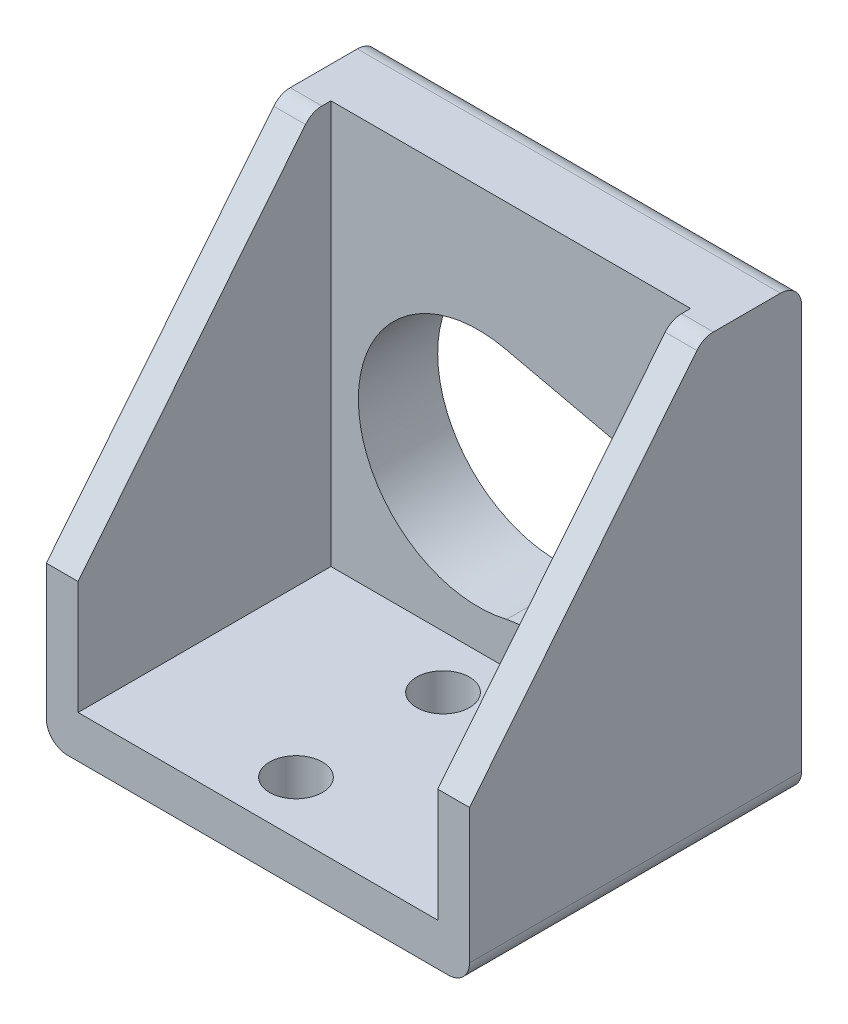
ISO-10303-21;
HEADER;
FILE_DESCRIPTION(('STEP AP214'),'2;1');
FILE_NAME('part.step','',(''),(''),'','','');
FILE_SCHEMA(('AUTOMOTIVE_DESIGN { 1 0 10303 214 1 1 1 1 }'));
ENDSEC;
DATA;
#1=APPLICATION_CONTEXT('core data for automotive mechanical design processes');
#2=APPLICATION_PROTOCOL_DEFINITION('international standard','automotive_design',2000,#1);
#3=PRODUCT_CONTEXT('',#1,'mechanical');
#4=PRODUCT('Part','Part','',(#3));
#5=PRODUCT_RELATED_PRODUCT_CATEGORY('part','',(#4));
#6=PRODUCT_DEFINITION_FORMATION('','',#4);
#7=PRODUCT_DEFINITION_CONTEXT('part definition',#1,'design');
#8=PRODUCT_DEFINITION('design','',#6,#7);
#9=PRODUCT_DEFINITION_SHAPE('','',#8);
#10=(LENGTH_UNIT() NAMED_UNIT(*) SI_UNIT(.MILLI.,.METRE.));
#11=(NAMED_UNIT(*) PLANE_ANGLE_UNIT() SI_UNIT($,.RADIAN.));
#12=(NAMED_UNIT(*) SI_UNIT($,.STERADIAN.) SOLID_ANGLE_UNIT());
#13=UNCERTAINTY_MEASURE_WITH_UNIT(LENGTH_MEASURE(1.E-05),#10,'distance_accuracy_value','');
#14=(GEOMETRIC_REPRESENTATION_CONTEXT(3) GLOBAL_UNCERTAINTY_ASSIGNED_CONTEXT((#13)) GLOBAL_UNIT_ASSIGNED_CONTEXT((#10,
#11,#12)) REPRESENTATION_CONTEXT('',''));
#15=CARTESIAN_POINT('',(0.,0.,0.));
#16=DIRECTION('',(0.,0.,1.));
#17=DIRECTION('',(1.,0.,0.));
#18=AXIS2_PLACEMENT_3D('',#15,#16,#17);
#19=CARTESIAN_POINT('',(0.,53.4999263468255,0.));
#20=DIRECTION('',(0.,0.,-1.));
#21=DIRECTION('',(-1.,0.,0.));
#22=AXIS2_PLACEMENT_3D('',#19,#20,#21);
#23=PLANE('',#22);
#24=DIRECTION('',(1.,0.,0.));
#25=VECTOR('',#24,1.);
#26=CARTESIAN_POINT('',(0.,0.,0.));
#27=LINE('',#26,#25);
#28=CARTESIAN_POINT('',(2.54,0.,0.));
#29=VERTEX_POINT('',#28);
#30=CARTESIAN_POINT('',(48.26,0.,0.));
#31=VERTEX_POINT('',#30);
#32=EDGE_CURVE('E244',#29,#31,#27,.T.);
#33=ORIENTED_EDGE('',*,*,#32,.T.);
#34=CARTESIAN_POINT('',(48.26,2.54,0.));
#35=DIRECTION('',(0.,0.,-1.));
#36=DIRECTION('',(-1.,0.,0.));
#37=AXIS2_PLACEMENT_3D('',#34,#35,#36);
#38=CIRCLE('',#37,2.54);
#39=CARTESIAN_POINT('',(50.8,2.54,0.));
#40=VERTEX_POINT('',#39);
#41=EDGE_CURVE('E41',#31,#40,#38,.F.);
#42=ORIENTED_EDGE('',*,*,#41,.T.);
#43=DIRECTION('',(0.,-1.,0.));
#44=VECTOR('',#43,1.);
#45=CARTESIAN_POINT('',(50.8,53.4999263468255,0.));
#46=LINE('',#45,#44);
#47=CARTESIAN_POINT('',(50.8,18.7019263468255,0.));
#48=VERTEX_POINT('',#47);
#49=EDGE_CURVE('E262',#48,#40,#46,.T.);
#50=ORIENTED_EDGE('',*,*,#49,.F.);
#51=DIRECTION('',(-1.,0.,0.));
#52=VECTOR('',#51,1.);
#53=CARTESIAN_POINT('',(50.8,18.7019263468255,0.));
#54=LINE('',#53,#52);
#55=CARTESIAN_POINT('',(46.99,18.7019263468255,0.));
#56=VERTEX_POINT('',#55);
#57=EDGE_CURVE('E218',#48,#56,#54,.T.);
#58=ORIENTED_EDGE('',*,*,#57,.T.);
#59=DIRECTION('',(0.,1.,0.));
#60=VECTOR('',#59,1.);
#61=CARTESIAN_POINT('',(46.99,5.08,0.));
#62=LINE('',#61,#60);
#63=CARTESIAN_POINT('',(46.99,5.08,0.));
#64=VERTEX_POINT('',#63);
#65=EDGE_CURVE('E237',#64,#56,#62,.T.);
#66=ORIENTED_EDGE('',*,*,#65,.F.);
#67=DIRECTION('',(1.,0.,0.));
#68=VECTOR('',#67,1.);
#69=CARTESIAN_POINT('',(3.81,5.08,0.));
#70=LINE('',#69,#68);
#71=CARTESIAN_POINT('',(3.81,5.08,0.));
#72=VERTEX_POINT('',#71);
#73=EDGE_CURVE('E224',#72,#64,#70,.T.);
#74=ORIENTED_EDGE('',*,*,#73,.F.);
#75=DIRECTION('',(0.,1.,0.));
#76=VECTOR('',#75,1.);
#77=CARTESIAN_POINT('',(3.81,5.08,0.));
#78=LINE('',#77,#76);
#79=CARTESIAN_POINT('',(3.81,18.7019263468255,0.));
#80=VERTEX_POINT('',#79);
#81=EDGE_CURVE('E229',#72,#80,#78,.T.);
#82=ORIENTED_EDGE('',*,*,#81,.T.);
#83=CARTESIAN_POINT('',(0.,18.7019263468255,0.));
#84=VERTEX_POINT('',#83);
#85=EDGE_CURVE('E216',#80,#84,#54,.T.);
#86=ORIENTED_EDGE('',*,*,#85,.T.);
#87=DIRECTION('',(0.,-1.,0.));
#88=VECTOR('',#87,1.);
#89=CARTESIAN_POINT('',(0.,53.4999263468255,0.));
#90=LINE('',#89,#88);
#91=CARTESIAN_POINT('',(0.,2.54,0.));
#92=VERTEX_POINT('',#91);
#93=EDGE_CURVE('E265',#84,#92,#90,.T.);
#94=ORIENTED_EDGE('',*,*,#93,.T.);
#95=CARTESIAN_POINT('',(2.54,2.54,0.));
#96=DIRECTION('',(0.,0.,-1.));
#97=DIRECTION('',(-1.,0.,0.));
#98=AXIS2_PLACEMENT_3D('',#95,#96,#97);
#99=CIRCLE('',#98,2.54);
#100=EDGE_CURVE('E318',#92,#29,#99,.F.);
#101=ORIENTED_EDGE('',*,*,#100,.T.);
#102=EDGE_LOOP('',(#33,#42,#50,#58,#66,#74,#82,#86,#94,#101));
#103=FACE_BOUND('',#102,.T.);
#104=ADVANCED_FACE('F33',(#103),#23,.F.);
#105=CARTESIAN_POINT('',(0.,53.4999263468255,0.));
#106=DIRECTION('',(0.,-1.,0.));
#107=DIRECTION('',(0.,0.,-1.));
#108=AXIS2_PLACEMENT_3D('',#105,#106,#107);
#109=PLANE('',#108);
#110=DIRECTION('',(0.,0.,1.));
#111=VECTOR('',#110,1.);
#112=CARTESIAN_POINT('',(0.,53.4999263468255,0.));
#113=LINE('',#112,#111);
#114=CARTESIAN_POINT('',(0.,53.4999263468255,-37.338));
#115=VERTEX_POINT('',#114);
#116=CARTESIAN_POINT('',(0.,53.4999263468255,-29.2815507378791));
#117=VERTEX_POINT('',#116);
#118=EDGE_CURVE('E246',#115,#117,#113,.T.);
#119=ORIENTED_EDGE('',*,*,#118,.T.);
#120=DIRECTION('',(-1.,0.,0.));
#121=VECTOR('',#120,1.);
#122=CARTESIAN_POINT('',(0.,53.4999263468255,-29.2815507378791));
#123=LINE('',#122,#121);
#124=CARTESIAN_POINT('',(3.81,53.4999263468255,-29.2815507378791));
#125=VERTEX_POINT('',#124);
#126=EDGE_CURVE('E296',#117,#125,#123,.F.);
#127=ORIENTED_EDGE('',*,*,#126,.T.);
#128=DIRECTION('',(0.,0.,1.));
#129=VECTOR('',#128,1.);
#130=CARTESIAN_POINT('',(3.81,53.4999263468255,0.));
#131=LINE('',#130,#129);
#132=CARTESIAN_POINT('',(3.81,53.4999263468255,-30.353));
#133=VERTEX_POINT('',#132);
#134=EDGE_CURVE('E273',#133,#125,#131,.T.);
#135=ORIENTED_EDGE('',*,*,#134,.F.);
#136=DIRECTION('',(-1.,0.,0.));
#137=VECTOR('',#136,1.);
#138=CARTESIAN_POINT('',(0.,53.4999263468255,-30.353));
#139=LINE('',#138,#137);
#140=CARTESIAN_POINT('',(46.99,53.4999263468255,-30.353));
#141=VERTEX_POINT('',#140);
#142=EDGE_CURVE('E268',#141,#133,#139,.T.);
#143=ORIENTED_EDGE('',*,*,#142,.F.);
#144=DIRECTION('',(0.,0.,1.));
#145=VECTOR('',#144,1.);
#146=CARTESIAN_POINT('',(46.99,53.4999263468255,0.));
#147=LINE('',#146,#145);
#148=CARTESIAN_POINT('',(46.99,53.4999263468255,-29.2815507378791));
#149=VERTEX_POINT('',#148);
#150=EDGE_CURVE('E270',#141,#149,#147,.T.);
#151=ORIENTED_EDGE('',*,*,#150,.T.);
#152=DIRECTION('',(-1.,0.,0.));
#153=VECTOR('',#152,1.);
#154=CARTESIAN_POINT('',(0.,53.4999263468255,-29.2815507378791));
#155=LINE('',#154,#153);
#156=CARTESIAN_POINT('',(50.8,53.4999263468255,-29.2815507378791));
#157=VERTEX_POINT('',#156);
#158=EDGE_CURVE('E294',#149,#157,#155,.F.);
#159=ORIENTED_EDGE('',*,*,#158,.T.);
#160=DIRECTION('',(0.,0.,-1.));
#161=VECTOR('',#160,1.);
#162=CARTESIAN_POINT('',(50.8,53.4999263468255,0.));
#163=LINE('',#162,#161);
#164=CARTESIAN_POINT('',(50.8,53.4999263468255,-37.338));
#165=VERTEX_POINT('',#164);
#166=EDGE_CURVE('E249',#157,#165,#163,.T.);
#167=ORIENTED_EDGE('',*,*,#166,.T.);
#168=DIRECTION('',(-1.,0.,0.));
#169=VECTOR('',#168,1.);
#170=CARTESIAN_POINT('',(0.,53.4999263468255,-37.338));
#171=LINE('',#170,#169);
#172=EDGE_CURVE('E279',#165,#115,#171,.T.);
#173=ORIENTED_EDGE('',*,*,#172,.T.);
#174=EDGE_LOOP('',(#119,#127,#135,#143,#151,#159,#167,#173));
#175=FACE_BOUND('',#174,.T.);
#176=ADVANCED_FACE('F352',(#175),#109,.F.);
#177=CARTESIAN_POINT('',(0.,53.4999263468255,0.));
#178=DIRECTION('',(1.,0.,0.));
#179=DIRECTION('',(0.,0.,-1.));
#180=AXIS2_PLACEMENT_3D('',#177,#178,#179);
#181=PLANE('',#180);
#182=DIRECTION('',(0.,-1.,0.));
#183=VECTOR('',#182,1.);
#184=CARTESIAN_POINT('',(0.,53.4999263468255,-39.878));
#185=LINE('',#184,#183);
#186=CARTESIAN_POINT('',(0.,50.9599263468255,-39.878));
#187=VERTEX_POINT('',#186);
#188=CARTESIAN_POINT('',(0.,2.54,-39.878));
#189=VERTEX_POINT('',#188);
#190=EDGE_CURVE('E252',#187,#189,#185,.T.);
#191=ORIENTED_EDGE('',*,*,#190,.T.);
#192=DIRECTION('',(0.,0.,1.));
#193=VECTOR('',#192,1.);
#194=CARTESIAN_POINT('',(0.,2.54,0.));
#195=LINE('',#194,#193);
#196=EDGE_CURVE('E11',#189,#92,#195,.T.);
#197=ORIENTED_EDGE('',*,*,#196,.T.);
#198=ORIENTED_EDGE('',*,*,#93,.F.);
#199=DIRECTION('',(0.,-0.778368258805354,0.627807975167822));
#200=VECTOR('',#199,1.);
#201=CARTESIAN_POINT('',(0.,18.7019263468255,0.));
#202=LINE('',#201,#200);
#203=CARTESIAN_POINT('',(0.,52.5545586037518,-27.3044953605135));
#204=VERTEX_POINT('',#203);
#205=EDGE_CURVE('E211',#204,#84,#202,.T.);
#206=ORIENTED_EDGE('',*,*,#205,.F.);
#207=CARTESIAN_POINT('',(0.,50.9599263468255,-29.2815507378791));
#208=DIRECTION('',(1.,0.,0.));
#209=DIRECTION('',(0.,0.,-1.));
#210=AXIS2_PLACEMENT_3D('',#207,#208,#209);
#211=CIRCLE('',#210,2.54);
#212=EDGE_CURVE('E292',#204,#117,#211,.F.);
#213=ORIENTED_EDGE('',*,*,#212,.T.);
#214=ORIENTED_EDGE('',*,*,#118,.F.);
#215=CARTESIAN_POINT('',(0.,50.9599263468255,-37.338));
#216=DIRECTION('',(1.,0.,0.));
#217=DIRECTION('',(0.,0.,-1.));
#218=AXIS2_PLACEMENT_3D('',#215,#216,#217);
#219=CIRCLE('',#218,2.54);
#220=EDGE_CURVE('E282',#115,#187,#219,.F.);
#221=ORIENTED_EDGE('',*,*,#220,.T.);
#222=EDGE_LOOP('',(#191,#197,#198,#206,#213,#214,#221));
#223=FACE_BOUND('',#222,.T.);
#224=ADVANCED_FACE('F344',(#223),#181,.F.);
#225=CARTESIAN_POINT('',(50.8,53.4999263468255,0.));
#226=DIRECTION('',(-1.,0.,0.));
#227=DIRECTION('',(0.,0.,1.));
#228=AXIS2_PLACEMENT_3D('',#225,#226,#227);
#229=PLANE('',#228);
#230=ORIENTED_EDGE('',*,*,#49,.T.);
#231=DIRECTION('',(0.,0.,-1.));
#232=VECTOR('',#231,1.);
#233=CARTESIAN_POINT('',(50.8,2.54,-39.878));
#234=LINE('',#233,#232);
#235=CARTESIAN_POINT('',(50.8,2.54,-39.878));
#236=VERTEX_POINT('',#235);
#237=EDGE_CURVE('E307',#40,#236,#234,.T.);
#238=ORIENTED_EDGE('',*,*,#237,.T.);
#239=DIRECTION('',(0.,-1.,0.));
#240=VECTOR('',#239,1.);
#241=CARTESIAN_POINT('',(50.8,53.4999263468255,-39.878));
#242=LINE('',#241,#240);
#243=CARTESIAN_POINT('',(50.8,50.9599263468255,-39.878));
#244=VERTEX_POINT('',#243);
#245=EDGE_CURVE('E259',#244,#236,#242,.T.);
#246=ORIENTED_EDGE('',*,*,#245,.F.);
#247=CARTESIAN_POINT('',(50.8,50.9599263468255,-37.338));
#248=DIRECTION('',(-1.,0.,0.));
#249=DIRECTION('',(0.,0.,1.));
#250=AXIS2_PLACEMENT_3D('',#247,#248,#249);
#251=CIRCLE('',#250,2.54);
#252=EDGE_CURVE('E286',#244,#165,#251,.F.);
#253=ORIENTED_EDGE('',*,*,#252,.T.);
#254=ORIENTED_EDGE('',*,*,#166,.F.);
#255=CARTESIAN_POINT('',(50.8,50.9599263468255,-29.2815507378791));
#256=DIRECTION('',(-1.,0.,0.));
#257=DIRECTION('',(0.,0.,1.));
#258=AXIS2_PLACEMENT_3D('',#255,#256,#257);
#259=CIRCLE('',#258,2.54);
#260=CARTESIAN_POINT('',(50.8,52.5545586037518,-27.3044953605135));
#261=VERTEX_POINT('',#260);
#262=EDGE_CURVE('E305',#157,#261,#259,.F.);
#263=ORIENTED_EDGE('',*,*,#262,.T.);
#264=DIRECTION('',(0.,-0.778368258805354,0.627807975167822));
#265=VECTOR('',#264,1.);
#266=CARTESIAN_POINT('',(50.8,18.7019263468255,0.));
#267=LINE('',#266,#265);
#268=EDGE_CURVE('E214',#261,#48,#267,.T.);
#269=ORIENTED_EDGE('',*,*,#268,.T.);
#270=EDGE_LOOP('',(#230,#238,#246,#253,#254,#263,#269));
#271=FACE_BOUND('',#270,.T.);
#272=ADVANCED_FACE('F327',(#271),#229,.F.);
#273=CARTESIAN_POINT('',(0.,53.4999263468255,-39.878));
#274=DIRECTION('',(0.,0.,1.));
#275=DIRECTION('',(1.,0.,0.));
#276=AXIS2_PLACEMENT_3D('',#273,#274,#275);
#277=PLANE('',#276);
#278=DIRECTION('',(0.,1.,0.));
#279=VECTOR('',#278,1.);
#280=CARTESIAN_POINT('',(45.0784733147199,53.4999263468255,-39.878));
#281=LINE('',#280,#279);
#282=CARTESIAN_POINT('',(45.0784733147199,13.162010507049,-39.878));
#283=VERTEX_POINT('',#282);
#284=CARTESIAN_POINT('',(45.0784733147199,33.5411113300649,-39.878));
#285=VERTEX_POINT('',#284);
#286=EDGE_CURVE('E195',#283,#285,#281,.T.);
#287=ORIENTED_EDGE('',*,*,#286,.T.);
#288=DIRECTION('',(-0.975008544208244,0.222167366462587,0.));
#289=VECTOR('',#288,1.);
#290=CARTESIAN_POINT('',(-2.09838176755371,44.2909224100561,-39.878));
#291=LINE('',#290,#289);
#292=CARTESIAN_POINT('',(24.7121631716682,38.181818856086,-39.878));
#293=VERTEX_POINT('',#292);
#294=EDGE_CURVE('E198',#285,#293,#291,.T.);
#295=ORIENTED_EDGE('',*,*,#294,.T.);
#296=CARTESIAN_POINT('',(21.5114460267199,24.1350818685278,-39.878));
#297=DIRECTION('',(0.,0.,1.));
#298=DIRECTION('',(1.,0.,0.));
#299=AXIS2_PLACEMENT_3D('',#296,#297,#298);
#300=CIRCLE('',#299,14.40678348);
#301=CARTESIAN_POINT('',(24.9019676800783,10.132947275627,-39.878));
#302=VERTEX_POINT('',#301);
#303=EDGE_CURVE('E190',#293,#302,#300,.T.);
#304=ORIENTED_EDGE('',*,*,#303,.T.);
#305=DIRECTION('',(0.988917741215768,0.148464477598861,0.));
#306=VECTOR('',#305,1.);
#307=CARTESIAN_POINT('',(6.91598498709369,7.43274339281137,-39.878));
#308=LINE('',#307,#306);
#309=EDGE_CURVE('E170',#302,#283,#308,.T.);
#310=ORIENTED_EDGE('',*,*,#309,.T.);
#311=EDGE_LOOP('',(#287,#295,#304,#310));
#312=FACE_BOUND('',#311,.T.);
#313=ORIENTED_EDGE('',*,*,#245,.T.);
#314=CARTESIAN_POINT('',(48.26,2.54,-39.878));
#315=DIRECTION('',(0.,0.,1.));
#316=DIRECTION('',(1.,0.,0.));
#317=AXIS2_PLACEMENT_3D('',#314,#315,#316);
#318=CIRCLE('',#317,2.54);
#319=CARTESIAN_POINT('',(48.26,0.,-39.878));
#320=VERTEX_POINT('',#319);
#321=EDGE_CURVE('E312',#236,#320,#318,.F.);
#322=ORIENTED_EDGE('',*,*,#321,.T.);
#323=DIRECTION('',(-1.,0.,0.));
#324=VECTOR('',#323,1.);
#325=CARTESIAN_POINT('',(0.,0.,-39.878));
#326=LINE('',#325,#324);
#327=CARTESIAN_POINT('',(2.54,0.,-39.878));
#328=VERTEX_POINT('',#327);
#329=EDGE_CURVE('E250',#320,#328,#326,.T.);
#330=ORIENTED_EDGE('',*,*,#329,.T.);
#331=CARTESIAN_POINT('',(2.54,2.54,-39.878));
#332=DIRECTION('',(0.,0.,1.));
#333=DIRECTION('',(1.,0.,0.));
#334=AXIS2_PLACEMENT_3D('',#331,#332,#333);
#335=CIRCLE('',#334,2.54);
#336=EDGE_CURVE('E310',#328,#189,#335,.F.);
#337=ORIENTED_EDGE('',*,*,#336,.T.);
#338=ORIENTED_EDGE('',*,*,#190,.F.);
#339=DIRECTION('',(-1.,0.,0.));
#340=VECTOR('',#339,1.);
#341=CARTESIAN_POINT('',(0.,50.9599263468255,-39.878));
#342=LINE('',#341,#340);
#343=EDGE_CURVE('E284',#187,#244,#342,.F.);
#344=ORIENTED_EDGE('',*,*,#343,.T.);
#345=EDGE_LOOP('',(#313,#322,#330,#337,#338,#344));
#346=FACE_BOUND('',#345,.T.);
#347=ADVANCED_FACE('F334',(#312,#346),#277,.F.);
#348=CARTESIAN_POINT('',(0.,0.,0.));
#349=DIRECTION('',(0.,-1.,0.));
#350=DIRECTION('',(0.,0.,-1.));
#351=AXIS2_PLACEMENT_3D('',#348,#349,#350);
#352=PLANE('',#351);
#353=CARTESIAN_POINT('',(23.622,0.,-24.003));
#354=DIRECTION('',(0.,1.,0.));
#355=DIRECTION('',(0.,0.,1.));
#356=AXIS2_PLACEMENT_3D('',#353,#354,#355);
#357=CIRCLE('',#356,3.175);
#358=CARTESIAN_POINT('',(23.622,0.,-20.828));
#359=VERTEX_POINT('',#358);
#360=EDGE_CURVE('E201',#359,#359,#357,.T.);
#361=ORIENTED_EDGE('',*,*,#360,.T.);
#362=EDGE_LOOP('',(#361));
#363=FACE_BOUND('',#362,.T.);
#364=CARTESIAN_POINT('',(23.622,0.,-6.35));
#365=DIRECTION('',(0.,1.,0.));
#366=DIRECTION('',(0.,0.,1.));
#367=AXIS2_PLACEMENT_3D('',#364,#365,#366);
#368=CIRCLE('',#367,3.175);
#369=CARTESIAN_POINT('',(23.622,0.,-3.175));
#370=VERTEX_POINT('',#369);
#371=EDGE_CURVE('E208',#370,#370,#368,.T.);
#372=ORIENTED_EDGE('',*,*,#371,.T.);
#373=EDGE_LOOP('',(#372));
#374=FACE_BOUND('',#373,.T.);
#375=ORIENTED_EDGE('',*,*,#329,.F.);
#376=DIRECTION('',(0.,0.,-1.));
#377=VECTOR('',#376,1.);
#378=CARTESIAN_POINT('',(48.26,0.,0.));
#379=LINE('',#378,#377);
#380=EDGE_CURVE('E316',#320,#31,#379,.F.);
#381=ORIENTED_EDGE('',*,*,#380,.T.);
#382=ORIENTED_EDGE('',*,*,#32,.F.);
#383=DIRECTION('',(0.,0.,1.));
#384=VECTOR('',#383,1.);
#385=CARTESIAN_POINT('',(2.54,0.,-39.878));
#386=LINE('',#385,#384);
#387=EDGE_CURVE('E314',#29,#328,#386,.F.);
#388=ORIENTED_EDGE('',*,*,#387,.T.);
#389=EDGE_LOOP('',(#375,#381,#382,#388));
#390=FACE_BOUND('',#389,.T.);
#391=ADVANCED_FACE('F337',(#363,#374,#390),#352,.T.);
#392=CARTESIAN_POINT('',(3.81,5.08,-30.353));
#393=DIRECTION('',(1.,0.,0.));
#394=DIRECTION('',(0.,0.,-1.));
#395=AXIS2_PLACEMENT_3D('',#392,#393,#394);
#396=PLANE('',#395);
#397=ORIENTED_EDGE('',*,*,#134,.T.);
#398=CARTESIAN_POINT('',(3.81,50.9599263468255,-29.2815507378791));
#399=DIRECTION('',(1.,0.,0.));
#400=DIRECTION('',(0.,0.,-1.));
#401=AXIS2_PLACEMENT_3D('',#398,#399,#400);
#402=CIRCLE('',#401,2.54);
#403=CARTESIAN_POINT('',(3.81,52.5545586037518,-27.3044953605135));
#404=VERTEX_POINT('',#403);
#405=EDGE_CURVE('E298',#125,#404,#402,.T.);
#406=ORIENTED_EDGE('',*,*,#405,.T.);
#407=DIRECTION('',(0.,0.778368258805354,-0.627807975167822));
#408=VECTOR('',#407,1.);
#409=CARTESIAN_POINT('',(3.81,25.2814579654551,-5.30684849531806));
#410=LINE('',#409,#408);
#411=EDGE_CURVE('E221',#80,#404,#410,.T.);
#412=ORIENTED_EDGE('',*,*,#411,.F.);
#413=ORIENTED_EDGE('',*,*,#81,.F.);
#414=DIRECTION('',(0.,0.,1.));
#415=VECTOR('',#414,1.);
#416=CARTESIAN_POINT('',(3.81,5.08,-30.353));
#417=LINE('',#416,#415);
#418=CARTESIAN_POINT('',(3.81,5.08,-30.353));
#419=VERTEX_POINT('',#418);
#420=EDGE_CURVE('E242',#419,#72,#417,.T.);
#421=ORIENTED_EDGE('',*,*,#420,.F.);
#422=DIRECTION('',(0.,1.,0.));
#423=VECTOR('',#422,1.);
#424=CARTESIAN_POINT('',(3.81,5.08,-30.353));
#425=LINE('',#424,#423);
#426=EDGE_CURVE('E231',#419,#133,#425,.T.);
#427=ORIENTED_EDGE('',*,*,#426,.T.);
#428=EDGE_LOOP('',(#397,#406,#412,#413,#421,#427));
#429=FACE_BOUND('',#428,.T.);
#430=ADVANCED_FACE('F376',(#429),#396,.T.);
#431=CARTESIAN_POINT('',(46.99,5.08,-30.353));
#432=DIRECTION('',(1.,0.,0.));
#433=DIRECTION('',(0.,0.,-1.));
#434=AXIS2_PLACEMENT_3D('',#431,#432,#433);
#435=PLANE('',#434);
#436=DIRECTION('',(0.,0.778368258805354,-0.627807975167822));
#437=VECTOR('',#436,1.);
#438=CARTESIAN_POINT('',(46.99,25.2814579654551,-5.30684849531806));
#439=LINE('',#438,#437);
#440=CARTESIAN_POINT('',(46.99,52.5545586037518,-27.3044953605135));
#441=VERTEX_POINT('',#440);
#442=EDGE_CURVE('E276',#56,#441,#439,.T.);
#443=ORIENTED_EDGE('',*,*,#442,.T.);
#444=CARTESIAN_POINT('',(46.99,50.9599263468255,-29.2815507378791));
#445=DIRECTION('',(1.,0.,0.));
#446=DIRECTION('',(0.,0.,-1.));
#447=AXIS2_PLACEMENT_3D('',#444,#445,#446);
#448=CIRCLE('',#447,2.54);
#449=EDGE_CURVE('E303',#441,#149,#448,.F.);
#450=ORIENTED_EDGE('',*,*,#449,.T.);
#451=ORIENTED_EDGE('',*,*,#150,.F.);
#452=DIRECTION('',(0.,1.,0.));
#453=VECTOR('',#452,1.);
#454=CARTESIAN_POINT('',(46.99,5.08,-30.353));
#455=LINE('',#454,#453);
#456=CARTESIAN_POINT('',(46.99,5.08,-30.353));
#457=VERTEX_POINT('',#456);
#458=EDGE_CURVE('E228',#457,#141,#455,.T.);
#459=ORIENTED_EDGE('',*,*,#458,.F.);
#460=DIRECTION('',(0.,0.,1.));
#461=VECTOR('',#460,1.);
#462=CARTESIAN_POINT('',(46.99,5.08,-30.353));
#463=LINE('',#462,#461);
#464=EDGE_CURVE('E234',#457,#64,#463,.T.);
#465=ORIENTED_EDGE('',*,*,#464,.T.);
#466=ORIENTED_EDGE('',*,*,#65,.T.);
#467=EDGE_LOOP('',(#443,#450,#451,#459,#465,#466));
#468=FACE_BOUND('',#467,.T.);
#469=ADVANCED_FACE('F363',(#468),#435,.F.);
#470=CARTESIAN_POINT('',(0.,0.,-30.353));
#471=DIRECTION('',(0.,0.,1.));
#472=DIRECTION('',(1.,0.,0.));
#473=AXIS2_PLACEMENT_3D('',#470,#471,#472);
#474=PLANE('',#473);
#475=DIRECTION('',(-0.975008544208243,0.222167366462587,0.));
#476=VECTOR('',#475,1.);
#477=CARTESIAN_POINT('',(45.0784733147199,33.5411113300649,-30.353));
#478=LINE('',#477,#476);
#479=CARTESIAN_POINT('',(45.0784733147199,33.5411113300649,-30.353));
#480=VERTEX_POINT('',#479);
#481=CARTESIAN_POINT('',(24.7121631716682,38.181818856086,-30.353));
#482=VERTEX_POINT('',#481);
#483=EDGE_CURVE('E56',#480,#482,#478,.T.);
#484=ORIENTED_EDGE('',*,*,#483,.F.);
#485=DIRECTION('',(0.,1.,0.));
#486=VECTOR('',#485,1.);
#487=CARTESIAN_POINT('',(45.0784733147199,33.5411113300649,-30.353));
#488=LINE('',#487,#486);
#489=CARTESIAN_POINT('',(45.0784733147199,13.162010507049,-30.353));
#490=VERTEX_POINT('',#489);
#491=EDGE_CURVE('E183',#490,#480,#488,.T.);
#492=ORIENTED_EDGE('',*,*,#491,.F.);
#493=DIRECTION('',(0.988917741215768,0.148464477598861,0.));
#494=VECTOR('',#493,1.);
#495=CARTESIAN_POINT('',(45.0784733147199,13.162010507049,-30.353));
#496=LINE('',#495,#494);
#497=CARTESIAN_POINT('',(24.9019676800783,10.132947275627,-30.353));
#498=VERTEX_POINT('',#497);
#499=EDGE_CURVE('E167',#498,#490,#496,.T.);
#500=ORIENTED_EDGE('',*,*,#499,.F.);
#501=CARTESIAN_POINT('',(21.5114460267199,24.1350818685278,-30.353));
#502=DIRECTION('',(0.,0.,1.));
#503=DIRECTION('',(1.,0.,0.));
#504=AXIS2_PLACEMENT_3D('',#501,#502,#503);
#505=CIRCLE('',#504,14.40678348);
#506=EDGE_CURVE('E176',#482,#498,#505,.T.);
#507=ORIENTED_EDGE('',*,*,#506,.F.);
#508=EDGE_LOOP('',(#484,#492,#500,#507));
#509=FACE_BOUND('',#508,.T.);
#510=ORIENTED_EDGE('',*,*,#142,.T.);
#511=ORIENTED_EDGE('',*,*,#426,.F.);
#512=DIRECTION('',(1.,0.,0.));
#513=VECTOR('',#512,1.);
#514=CARTESIAN_POINT('',(3.81,5.08,-30.353));
#515=LINE('',#514,#513);
#516=EDGE_CURVE('E225',#419,#457,#515,.T.);
#517=ORIENTED_EDGE('',*,*,#516,.T.);
#518=ORIENTED_EDGE('',*,*,#458,.T.);
#519=EDGE_LOOP('',(#510,#511,#517,#518));
#520=FACE_BOUND('',#519,.T.);
#521=ADVANCED_FACE('F180',(#509,#520),#474,.T.);
#522=CARTESIAN_POINT('',(3.81,5.08,-30.353));
#523=DIRECTION('',(0.,-1.,0.));
#524=DIRECTION('',(0.,0.,-1.));
#525=AXIS2_PLACEMENT_3D('',#522,#523,#524);
#526=PLANE('',#525);
#527=CARTESIAN_POINT('',(23.622,5.08,-24.003));
#528=DIRECTION('',(0.,1.,0.));
#529=DIRECTION('',(0.,0.,1.));
#530=AXIS2_PLACEMENT_3D('',#527,#528,#529);
#531=CIRCLE('',#530,3.175);
#532=CARTESIAN_POINT('',(23.622,5.08,-20.828));
#533=VERTEX_POINT('',#532);
#534=EDGE_CURVE('E202',#533,#533,#531,.T.);
#535=ORIENTED_EDGE('',*,*,#534,.F.);
#536=EDGE_LOOP('',(#535));
#537=FACE_BOUND('',#536,.T.);
#538=CARTESIAN_POINT('',(23.622,5.08,-6.35));
#539=DIRECTION('',(0.,1.,0.));
#540=DIRECTION('',(0.,0.,1.));
#541=AXIS2_PLACEMENT_3D('',#538,#539,#540);
#542=CIRCLE('',#541,3.175);
#543=CARTESIAN_POINT('',(23.622,5.08,-3.175));
#544=VERTEX_POINT('',#543);
#545=EDGE_CURVE('E205',#544,#544,#542,.T.);
#546=ORIENTED_EDGE('',*,*,#545,.F.);
#547=EDGE_LOOP('',(#546));
#548=FACE_BOUND('',#547,.T.);
#549=ORIENTED_EDGE('',*,*,#73,.T.);
#550=ORIENTED_EDGE('',*,*,#464,.F.);
#551=ORIENTED_EDGE('',*,*,#516,.F.);
#552=ORIENTED_EDGE('',*,*,#420,.T.);
#553=EDGE_LOOP('',(#549,#550,#551,#552));
#554=FACE_BOUND('',#553,.T.);
#555=ADVANCED_FACE('F371',(#537,#548,#554),#526,.F.);
#556=CARTESIAN_POINT('',(50.8,18.7019263468255,0.));
#557=DIRECTION('',(0.,-0.627807975167822,-0.778368258805354));
#558=DIRECTION('',(0.,0.778368258805354,-0.627807975167822));
#559=AXIS2_PLACEMENT_3D('',#556,#557,#558);
#560=PLANE('',#559);
#561=ORIENTED_EDGE('',*,*,#268,.F.);
#562=DIRECTION('',(-1.,0.,0.));
#563=VECTOR('',#562,1.);
#564=CARTESIAN_POINT('',(50.8,52.5545586037518,-27.3044953605135));
#565=LINE('',#564,#563);
#566=EDGE_CURVE('E300',#261,#441,#565,.T.);
#567=ORIENTED_EDGE('',*,*,#566,.T.);
#568=ORIENTED_EDGE('',*,*,#442,.F.);
#569=ORIENTED_EDGE('',*,*,#57,.F.);
#570=EDGE_LOOP('',(#561,#567,#568,#569));
#571=FACE_BOUND('',#570,.T.);
#572=ADVANCED_FACE('F361',(#571),#560,.F.);
#573=ORIENTED_EDGE('',*,*,#411,.T.);
#574=DIRECTION('',(-1.,0.,0.));
#575=VECTOR('',#574,1.);
#576=CARTESIAN_POINT('',(50.8,52.5545586037518,-27.3044953605135));
#577=LINE('',#576,#575);
#578=EDGE_CURVE('E289',#404,#204,#577,.T.);
#579=ORIENTED_EDGE('',*,*,#578,.T.);
#580=ORIENTED_EDGE('',*,*,#205,.T.);
#581=ORIENTED_EDGE('',*,*,#85,.F.);
#582=EDGE_LOOP('',(#573,#579,#580,#581));
#583=FACE_BOUND('',#582,.T.);
#584=ADVANCED_FACE('F380',(#583),#560,.F.);
#585=CARTESIAN_POINT('',(0.,50.9599263468255,-37.338));
#586=DIRECTION('',(-1.,0.,0.));
#587=DIRECTION('',(0.,0.,1.));
#588=AXIS2_PLACEMENT_3D('',#585,#586,#587);
#589=CYLINDRICAL_SURFACE('',#588,2.54);
#590=ORIENTED_EDGE('',*,*,#252,.F.);
#591=ORIENTED_EDGE('',*,*,#343,.F.);
#592=ORIENTED_EDGE('',*,*,#220,.F.);
#593=ORIENTED_EDGE('',*,*,#172,.F.);
#594=EDGE_LOOP('',(#590,#591,#592,#593));
#595=FACE_BOUND('',#594,.T.);
#596=ADVANCED_FACE('F350',(#595),#589,.T.);
#597=CARTESIAN_POINT('',(50.8,50.9599263468255,-29.2815507378791));
#598=DIRECTION('',(-1.,0.,0.));
#599=DIRECTION('',(0.,0.,1.));
#600=AXIS2_PLACEMENT_3D('',#597,#598,#599);
#601=CYLINDRICAL_SURFACE('',#600,2.54);
#602=ORIENTED_EDGE('',*,*,#405,.F.);
#603=ORIENTED_EDGE('',*,*,#126,.F.);
#604=ORIENTED_EDGE('',*,*,#212,.F.);
#605=ORIENTED_EDGE('',*,*,#578,.F.);
#606=EDGE_LOOP('',(#602,#603,#604,#605));
#607=FACE_BOUND('',#606,.T.);
#608=ADVANCED_FACE('F383',(#607),#601,.T.);
#609=CARTESIAN_POINT('',(50.8,50.9599263468255,-29.2815507378791));
#610=DIRECTION('',(-1.,0.,0.));
#611=DIRECTION('',(0.,0.,1.));
#612=AXIS2_PLACEMENT_3D('',#609,#610,#611);
#613=CYLINDRICAL_SURFACE('',#612,2.54);
#614=ORIENTED_EDGE('',*,*,#262,.F.);
#615=ORIENTED_EDGE('',*,*,#158,.F.);
#616=ORIENTED_EDGE('',*,*,#449,.F.);
#617=ORIENTED_EDGE('',*,*,#566,.F.);
#618=EDGE_LOOP('',(#614,#615,#616,#617));
#619=FACE_BOUND('',#618,.T.);
#620=ADVANCED_FACE('F359',(#619),#613,.T.);
#621=CARTESIAN_POINT('',(48.26,2.54,0.));
#622=DIRECTION('',(0.,0.,1.));
#623=DIRECTION('',(1.,0.,0.));
#624=AXIS2_PLACEMENT_3D('',#621,#622,#623);
#625=CYLINDRICAL_SURFACE('',#624,2.54);
#626=ORIENTED_EDGE('',*,*,#41,.F.);
#627=ORIENTED_EDGE('',*,*,#380,.F.);
#628=ORIENTED_EDGE('',*,*,#321,.F.);
#629=ORIENTED_EDGE('',*,*,#237,.F.);
#630=EDGE_LOOP('',(#626,#627,#628,#629));
#631=FACE_BOUND('',#630,.T.);
#632=ADVANCED_FACE('F331',(#631),#625,.T.);
#633=CARTESIAN_POINT('',(2.54,2.54,0.));
#634=DIRECTION('',(0.,0.,-1.));
#635=DIRECTION('',(-1.,0.,0.));
#636=AXIS2_PLACEMENT_3D('',#633,#634,#635);
#637=CYLINDRICAL_SURFACE('',#636,2.54);
#638=ORIENTED_EDGE('',*,*,#336,.F.);
#639=ORIENTED_EDGE('',*,*,#387,.F.);
#640=ORIENTED_EDGE('',*,*,#100,.F.);
#641=ORIENTED_EDGE('',*,*,#196,.F.);
#642=EDGE_LOOP('',(#638,#639,#640,#641));
#643=FACE_BOUND('',#642,.T.);
#644=ADVANCED_FACE('F35',(#643),#637,.T.);
#645=CARTESIAN_POINT('',(23.622,0.,-6.35));
#646=DIRECTION('',(0.,1.,0.));
#647=DIRECTION('',(0.,0.,1.));
#648=AXIS2_PLACEMENT_3D('',#645,#646,#647);
#649=CYLINDRICAL_SURFACE('',#648,3.175);
#650=ORIENTED_EDGE('',*,*,#371,.F.);
#651=EDGE_LOOP('',(#650));
#652=FACE_BOUND('',#651,.T.);
#653=ORIENTED_EDGE('',*,*,#545,.T.);
#654=EDGE_LOOP('',(#653));
#655=FACE_BOUND('',#654,.T.);
#656=ADVANCED_FACE('F417',(#652,#655),#649,.F.);
#657=CARTESIAN_POINT('',(23.622,0.,-24.003));
#658=DIRECTION('',(0.,1.,0.));
#659=DIRECTION('',(0.,0.,1.));
#660=AXIS2_PLACEMENT_3D('',#657,#658,#659);
#661=CYLINDRICAL_SURFACE('',#660,3.175);
#662=ORIENTED_EDGE('',*,*,#360,.F.);
#663=EDGE_LOOP('',(#662));
#664=FACE_BOUND('',#663,.T.);
#665=ORIENTED_EDGE('',*,*,#534,.T.);
#666=EDGE_LOOP('',(#665));
#667=FACE_BOUND('',#666,.T.);
#668=ADVANCED_FACE('F421',(#664,#667),#661,.F.);
#669=CARTESIAN_POINT('',(45.0784733147199,33.5411113300649,-55.753));
#670=DIRECTION('',(0.222167366462587,0.975008544208243,0.));
#671=DIRECTION('',(-0.975008544208244,0.222167366462587,0.));
#672=AXIS2_PLACEMENT_3D('',#669,#670,#671);
#673=PLANE('',#672);
#674=DIRECTION('',(0.,0.,1.));
#675=VECTOR('',#674,1.);
#676=CARTESIAN_POINT('',(45.0784733147199,33.5411113300649,-55.753));
#677=LINE('',#676,#675);
#678=EDGE_CURVE('E188',#285,#480,#677,.T.);
#679=ORIENTED_EDGE('',*,*,#678,.T.);
#680=ORIENTED_EDGE('',*,*,#483,.T.);
#681=DIRECTION('',(0.,0.,1.));
#682=VECTOR('',#681,1.);
#683=CARTESIAN_POINT('',(24.7121631716682,38.181818856086,-55.753));
#684=LINE('',#683,#682);
#685=EDGE_CURVE('E173',#293,#482,#684,.T.);
#686=ORIENTED_EDGE('',*,*,#685,.F.);
#687=ORIENTED_EDGE('',*,*,#294,.F.);
#688=EDGE_LOOP('',(#679,#680,#686,#687));
#689=FACE_BOUND('',#688,.T.);
#690=ADVANCED_FACE('F427',(#689),#673,.F.);
#691=CARTESIAN_POINT('',(45.0784733147199,33.5411113300649,-55.753));
#692=DIRECTION('',(1.,0.,0.));
#693=DIRECTION('',(0.,1.,0.));
#694=AXIS2_PLACEMENT_3D('',#691,#692,#693);
#695=PLANE('',#694);
#696=DIRECTION('',(0.,0.,1.));
#697=VECTOR('',#696,1.);
#698=CARTESIAN_POINT('',(45.0784733147199,13.162010507049,-55.753));
#699=LINE('',#698,#697);
#700=EDGE_CURVE('E172',#283,#490,#699,.T.);
#701=ORIENTED_EDGE('',*,*,#700,.T.);
#702=ORIENTED_EDGE('',*,*,#491,.T.);
#703=ORIENTED_EDGE('',*,*,#678,.F.);
#704=ORIENTED_EDGE('',*,*,#286,.F.);
#705=EDGE_LOOP('',(#701,#702,#703,#704));
#706=FACE_BOUND('',#705,.T.);
#707=ADVANCED_FACE('F483',(#706),#695,.F.);
#708=CARTESIAN_POINT('',(45.0784733147199,13.162010507049,-55.753));
#709=DIRECTION('',(0.148464477598861,-0.988917741215768,0.));
#710=DIRECTION('',(0.988917741215768,0.148464477598861,0.));
#711=AXIS2_PLACEMENT_3D('',#708,#709,#710);
#712=PLANE('',#711);
#713=DIRECTION('',(0.,0.,1.));
#714=VECTOR('',#713,1.);
#715=CARTESIAN_POINT('',(24.9019676800783,10.132947275627,-55.753));
#716=LINE('',#715,#714);
#717=EDGE_CURVE('E48',#302,#498,#716,.T.);
#718=ORIENTED_EDGE('',*,*,#717,.T.);
#719=ORIENTED_EDGE('',*,*,#499,.T.);
#720=ORIENTED_EDGE('',*,*,#700,.F.);
#721=ORIENTED_EDGE('',*,*,#309,.F.);
#722=EDGE_LOOP('',(#718,#719,#720,#721));
#723=FACE_BOUND('',#722,.T.);
#724=ADVANCED_FACE('F164',(#723),#712,.F.);
#725=CARTESIAN_POINT('',(21.5114460267199,24.1350818685278,-55.753));
#726=DIRECTION('',(0.,0.,1.));
#727=DIRECTION('',(1.,0.,0.));
#728=AXIS2_PLACEMENT_3D('',#725,#726,#727);
#729=CYLINDRICAL_SURFACE('',#728,14.40678348);
#730=ORIENTED_EDGE('',*,*,#685,.T.);
#731=ORIENTED_EDGE('',*,*,#506,.T.);
#732=ORIENTED_EDGE('',*,*,#717,.F.);
#733=ORIENTED_EDGE('',*,*,#303,.F.);
#734=EDGE_LOOP('',(#730,#731,#732,#733));
#735=FACE_BOUND('',#734,.T.);
#736=ADVANCED_FACE('F177',(#735),#729,.F.);
#737=CLOSED_SHELL('',(#104,#176,#224,#272,#347,#391,#430,#469,#521,#555,#572,#584,#596,#608,
#620,#632,#644,#656,#668,#690,#707,#724,#736));
#738=MANIFOLD_SOLID_BREP('B2',#737);
#739=ADVANCED_BREP_SHAPE_REPRESENTATION('',(#18,#738),#14);
#740=SHAPE_DEFINITION_REPRESENTATION(#9,#739);
ENDSEC;
END-ISO-10303-21;
